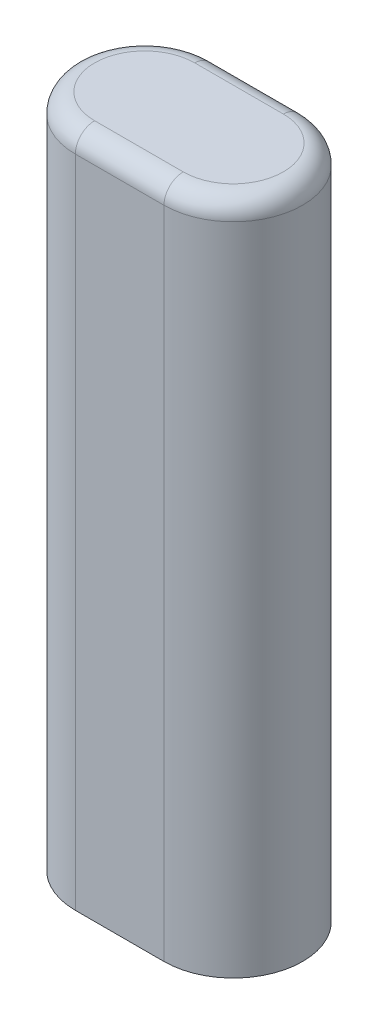
ISO-10303-21;
HEADER;
FILE_DESCRIPTION(('STEP AP214'),'2;1');
FILE_NAME('part.step','',(''),(''),'','','');
FILE_SCHEMA(('AUTOMOTIVE_DESIGN { 1 0 10303 214 1 1 1 1 }'));
ENDSEC;
DATA;
#1=APPLICATION_CONTEXT('core data for automotive mechanical design processes');
#2=APPLICATION_PROTOCOL_DEFINITION('international standard','automotive_design',2000,#1);
#3=PRODUCT_CONTEXT('',#1,'mechanical');
#4=PRODUCT('Part','Part','',(#3));
#5=PRODUCT_RELATED_PRODUCT_CATEGORY('part','',(#4));
#6=PRODUCT_DEFINITION_FORMATION('','',#4);
#7=PRODUCT_DEFINITION_CONTEXT('part definition',#1,'design');
#8=PRODUCT_DEFINITION('design','',#6,#7);
#9=PRODUCT_DEFINITION_SHAPE('','',#8);
#10=(LENGTH_UNIT() NAMED_UNIT(*) SI_UNIT(.MILLI.,.METRE.));
#11=(NAMED_UNIT(*) PLANE_ANGLE_UNIT() SI_UNIT($,.RADIAN.));
#12=(NAMED_UNIT(*) SI_UNIT($,.STERADIAN.) SOLID_ANGLE_UNIT());
#13=UNCERTAINTY_MEASURE_WITH_UNIT(LENGTH_MEASURE(1.E-05),#10,'distance_accuracy_value','');
#14=(GEOMETRIC_REPRESENTATION_CONTEXT(3) GLOBAL_UNCERTAINTY_ASSIGNED_CONTEXT((#13)) GLOBAL_UNIT_ASSIGNED_CONTEXT((#10,
#11,#12)) REPRESENTATION_CONTEXT('',''));
#15=CARTESIAN_POINT('',(0.,0.,0.));
#16=DIRECTION('',(0.,0.,1.));
#17=DIRECTION('',(1.,0.,0.));
#18=AXIS2_PLACEMENT_3D('',#15,#16,#17);
#19=CARTESIAN_POINT('',(-1.4605,22.225,0.));
#20=DIRECTION('',(0.,-1.,0.));
#21=DIRECTION('',(0.,0.,-1.));
#22=AXIS2_PLACEMENT_3D('',#19,#20,#21);
#23=CYLINDRICAL_SURFACE('',#22,2.286);
#24=DIRECTION('',(0.,-1.,0.));
#25=VECTOR('',#24,1.);
#26=CARTESIAN_POINT('',(-1.4605,22.225,2.286));
#27=LINE('',#26,#25);
#28=CARTESIAN_POINT('',(-1.4605,21.59,2.286));
#29=VERTEX_POINT('',#28);
#30=CARTESIAN_POINT('',(-1.4605,0.,2.286));
#31=VERTEX_POINT('',#30);
#32=EDGE_CURVE('E94',#29,#31,#27,.T.);
#33=ORIENTED_EDGE('',*,*,#32,.F.);
#34=CARTESIAN_POINT('',(-1.4605,21.59,0.));
#35=DIRECTION('',(0.,1.,0.));
#36=DIRECTION('',(0.,0.,1.));
#37=AXIS2_PLACEMENT_3D('',#34,#35,#36);
#38=CIRCLE('',#37,2.286);
#39=CARTESIAN_POINT('',(-1.4605,21.59,-2.286));
#40=VERTEX_POINT('',#39);
#41=EDGE_CURVE('E64',#29,#40,#38,.F.);
#42=ORIENTED_EDGE('',*,*,#41,.T.);
#43=DIRECTION('',(0.,-1.,0.));
#44=VECTOR('',#43,1.);
#45=CARTESIAN_POINT('',(-1.4605,22.225,-2.286));
#46=LINE('',#45,#44);
#47=CARTESIAN_POINT('',(-1.4605,0.,-2.286));
#48=VERTEX_POINT('',#47);
#49=EDGE_CURVE('E116',#40,#48,#46,.T.);
#50=ORIENTED_EDGE('',*,*,#49,.T.);
#51=CARTESIAN_POINT('',(-1.4605,0.,0.));
#52=DIRECTION('',(0.,1.,0.));
#53=DIRECTION('',(0.,0.,1.));
#54=AXIS2_PLACEMENT_3D('',#51,#52,#53);
#55=CIRCLE('',#54,2.286);
#56=EDGE_CURVE('E111',#48,#31,#55,.T.);
#57=ORIENTED_EDGE('',*,*,#56,.T.);
#58=EDGE_LOOP('',(#33,#42,#50,#57));
#59=FACE_BOUND('',#58,.T.);
#60=ADVANCED_FACE('F39',(#59),#23,.T.);
#61=CARTESIAN_POINT('',(-1.4605,22.225,2.286));
#62=DIRECTION('',(0.,0.,-1.));
#63=DIRECTION('',(-1.,0.,0.));
#64=AXIS2_PLACEMENT_3D('',#61,#62,#63);
#65=PLANE('',#64);
#66=DIRECTION('',(0.,-1.,0.));
#67=VECTOR('',#66,1.);
#68=CARTESIAN_POINT('',(1.4605,22.225,2.286));
#69=LINE('',#68,#67);
#70=CARTESIAN_POINT('',(1.4605,21.59,2.286));
#71=VERTEX_POINT('',#70);
#72=CARTESIAN_POINT('',(1.4605,0.,2.286));
#73=VERTEX_POINT('',#72);
#74=EDGE_CURVE('E105',#71,#73,#69,.T.);
#75=ORIENTED_EDGE('',*,*,#74,.F.);
#76=DIRECTION('',(1.,0.,0.));
#77=VECTOR('',#76,1.);
#78=CARTESIAN_POINT('',(-1.4605,21.59,2.286));
#79=LINE('',#78,#77);
#80=EDGE_CURVE('E101',#71,#29,#79,.F.);
#81=ORIENTED_EDGE('',*,*,#80,.T.);
#82=ORIENTED_EDGE('',*,*,#32,.T.);
#83=DIRECTION('',(1.,0.,0.));
#84=VECTOR('',#83,1.);
#85=CARTESIAN_POINT('',(-1.4605,0.,2.286));
#86=LINE('',#85,#84);
#87=EDGE_CURVE('E98',#31,#73,#86,.T.);
#88=ORIENTED_EDGE('',*,*,#87,.T.);
#89=EDGE_LOOP('',(#75,#81,#82,#88));
#90=FACE_BOUND('',#89,.T.);
#91=ADVANCED_FACE('F97',(#90),#65,.F.);
#92=CARTESIAN_POINT('',(1.4605,22.225,0.));
#93=DIRECTION('',(0.,-1.,0.));
#94=DIRECTION('',(0.,0.,-1.));
#95=AXIS2_PLACEMENT_3D('',#92,#93,#94);
#96=CYLINDRICAL_SURFACE('',#95,2.286);
#97=DIRECTION('',(0.,-1.,0.));
#98=VECTOR('',#97,1.);
#99=CARTESIAN_POINT('',(1.4605,22.225,-2.286));
#100=LINE('',#99,#98);
#101=CARTESIAN_POINT('',(1.4605,21.59,-2.286));
#102=VERTEX_POINT('',#101);
#103=CARTESIAN_POINT('',(1.4605,0.,-2.286));
#104=VERTEX_POINT('',#103);
#105=EDGE_CURVE('E134',#102,#104,#100,.T.);
#106=ORIENTED_EDGE('',*,*,#105,.F.);
#107=CARTESIAN_POINT('',(1.4605,21.59,0.));
#108=DIRECTION('',(0.,1.,0.));
#109=DIRECTION('',(0.,0.,1.));
#110=AXIS2_PLACEMENT_3D('',#107,#108,#109);
#111=CIRCLE('',#110,2.286);
#112=EDGE_CURVE('E11',#102,#71,#111,.F.);
#113=ORIENTED_EDGE('',*,*,#112,.T.);
#114=ORIENTED_EDGE('',*,*,#74,.T.);
#115=CARTESIAN_POINT('',(1.4605,0.,0.));
#116=DIRECTION('',(0.,1.,0.));
#117=DIRECTION('',(0.,0.,1.));
#118=AXIS2_PLACEMENT_3D('',#115,#116,#117);
#119=CIRCLE('',#118,2.286);
#120=EDGE_CURVE('E113',#73,#104,#119,.T.);
#121=ORIENTED_EDGE('',*,*,#120,.T.);
#122=EDGE_LOOP('',(#106,#113,#114,#121));
#123=FACE_BOUND('',#122,.T.);
#124=ADVANCED_FACE('F194',(#123),#96,.T.);
#125=CARTESIAN_POINT('',(-1.4605,22.225,-2.286));
#126=DIRECTION('',(0.,0.,1.));
#127=DIRECTION('',(1.,0.,0.));
#128=AXIS2_PLACEMENT_3D('',#125,#126,#127);
#129=PLANE('',#128);
#130=ORIENTED_EDGE('',*,*,#49,.F.);
#131=DIRECTION('',(-1.,0.,0.));
#132=VECTOR('',#131,1.);
#133=CARTESIAN_POINT('',(1.4605,21.59,-2.286));
#134=LINE('',#133,#132);
#135=EDGE_CURVE('E49',#40,#102,#134,.F.);
#136=ORIENTED_EDGE('',*,*,#135,.T.);
#137=ORIENTED_EDGE('',*,*,#105,.T.);
#138=DIRECTION('',(-1.,0.,0.));
#139=VECTOR('',#138,1.);
#140=CARTESIAN_POINT('',(-1.4605,0.,-2.286));
#141=LINE('',#140,#139);
#142=EDGE_CURVE('E129',#104,#48,#141,.T.);
#143=ORIENTED_EDGE('',*,*,#142,.T.);
#144=EDGE_LOOP('',(#130,#136,#137,#143));
#145=FACE_BOUND('',#144,.T.);
#146=ADVANCED_FACE('F216',(#145),#129,.F.);
#147=CARTESIAN_POINT('',(-1.4605,22.225,0.));
#148=DIRECTION('',(0.,1.,0.));
#149=DIRECTION('',(0.,0.,1.));
#150=AXIS2_PLACEMENT_3D('',#147,#148,#149);
#151=PLANE('',#150);
#152=CARTESIAN_POINT('',(-1.4605,22.225,0.));
#153=DIRECTION('',(0.,1.,0.));
#154=DIRECTION('',(0.,0.,1.));
#155=AXIS2_PLACEMENT_3D('',#152,#153,#154);
#156=CIRCLE('',#155,1.651);
#157=CARTESIAN_POINT('',(-1.4605,22.225,-1.651));
#158=VERTEX_POINT('',#157);
#159=CARTESIAN_POINT('',(-1.4605,22.225,1.651));
#160=VERTEX_POINT('',#159);
#161=EDGE_CURVE('E144',#158,#160,#156,.T.);
#162=ORIENTED_EDGE('',*,*,#161,.T.);
#163=DIRECTION('',(1.,0.,0.));
#164=VECTOR('',#163,1.);
#165=CARTESIAN_POINT('',(1.4605,22.225,1.651));
#166=LINE('',#165,#164);
#167=CARTESIAN_POINT('',(1.4605,22.225,1.651));
#168=VERTEX_POINT('',#167);
#169=EDGE_CURVE('E147',#160,#168,#166,.T.);
#170=ORIENTED_EDGE('',*,*,#169,.T.);
#171=CARTESIAN_POINT('',(1.4605,22.225,0.));
#172=DIRECTION('',(0.,1.,0.));
#173=DIRECTION('',(0.,0.,1.));
#174=AXIS2_PLACEMENT_3D('',#171,#172,#173);
#175=CIRCLE('',#174,1.651);
#176=CARTESIAN_POINT('',(1.4605,22.225,-1.651));
#177=VERTEX_POINT('',#176);
#178=EDGE_CURVE('E104',#168,#177,#175,.T.);
#179=ORIENTED_EDGE('',*,*,#178,.T.);
#180=DIRECTION('',(-1.,0.,0.));
#181=VECTOR('',#180,1.);
#182=CARTESIAN_POINT('',(-1.4605,22.225,-1.651));
#183=LINE('',#182,#181);
#184=EDGE_CURVE('E141',#177,#158,#183,.T.);
#185=ORIENTED_EDGE('',*,*,#184,.T.);
#186=EDGE_LOOP('',(#162,#170,#179,#185));
#187=FACE_BOUND('',#186,.T.);
#188=ADVANCED_FACE('F176',(#187),#151,.T.);
#189=CARTESIAN_POINT('',(-1.4605,0.,0.));
#190=DIRECTION('',(0.,1.,0.));
#191=DIRECTION('',(0.,0.,1.));
#192=AXIS2_PLACEMENT_3D('',#189,#190,#191);
#193=PLANE('',#192);
#194=CARTESIAN_POINT('',(0.,0.,0.));
#195=DIRECTION('',(0.,-1.,0.));
#196=DIRECTION('',(0.,0.,-1.));
#197=AXIS2_PLACEMENT_3D('',#194,#195,#196);
#198=CIRCLE('',#197,1.778);
#199=CARTESIAN_POINT('',(0.,0.,-1.778));
#200=VERTEX_POINT('',#199);
#201=EDGE_CURVE('E124',#200,#200,#198,.T.);
#202=ORIENTED_EDGE('',*,*,#201,.F.);
#203=EDGE_LOOP('',(#202));
#204=FACE_BOUND('',#203,.T.);
#205=ORIENTED_EDGE('',*,*,#56,.F.);
#206=ORIENTED_EDGE('',*,*,#142,.F.);
#207=ORIENTED_EDGE('',*,*,#120,.F.);
#208=ORIENTED_EDGE('',*,*,#87,.F.);
#209=EDGE_LOOP('',(#205,#206,#207,#208));
#210=FACE_BOUND('',#209,.T.);
#211=ADVANCED_FACE('F109',(#204,#210),#193,.F.);
#212=CARTESIAN_POINT('',(-1.4605,21.59,-1.651));
#213=DIRECTION('',(1.,0.,0.));
#214=DIRECTION('',(0.,0.,-1.));
#215=AXIS2_PLACEMENT_3D('',#212,#213,#214);
#216=CYLINDRICAL_SURFACE('',#215,0.635);
#217=CARTESIAN_POINT('',(1.4605,21.59,-1.651));
#218=DIRECTION('',(1.,0.,0.));
#219=DIRECTION('',(0.,0.,-1.));
#220=AXIS2_PLACEMENT_3D('',#217,#218,#219);
#221=CIRCLE('',#220,0.635);
#222=EDGE_CURVE('E122',#102,#177,#221,.T.);
#223=ORIENTED_EDGE('',*,*,#222,.F.);
#224=ORIENTED_EDGE('',*,*,#135,.F.);
#225=CARTESIAN_POINT('',(-1.4605,21.59,-1.651));
#226=DIRECTION('',(-1.,0.,0.));
#227=DIRECTION('',(0.,0.,1.));
#228=AXIS2_PLACEMENT_3D('',#225,#226,#227);
#229=CIRCLE('',#228,0.635);
#230=EDGE_CURVE('E43',#158,#40,#229,.T.);
#231=ORIENTED_EDGE('',*,*,#230,.F.);
#232=ORIENTED_EDGE('',*,*,#184,.F.);
#233=EDGE_LOOP('',(#223,#224,#231,#232));
#234=FACE_BOUND('',#233,.T.);
#235=ADVANCED_FACE('F41',(#234),#216,.T.);
#236=CARTESIAN_POINT('',(-1.4605,21.59,0.));
#237=DIRECTION('',(0.,1.,0.));
#238=DIRECTION('',(0.,0.,1.));
#239=AXIS2_PLACEMENT_3D('',#236,#237,#238);
#240=TOROIDAL_SURFACE('',#239,1.651,0.635);
#241=ORIENTED_EDGE('',*,*,#230,.T.);
#242=ORIENTED_EDGE('',*,*,#41,.F.);
#243=CARTESIAN_POINT('',(-1.4605,21.59,1.651));
#244=DIRECTION('',(1.,0.,0.));
#245=DIRECTION('',(0.,0.,-1.));
#246=AXIS2_PLACEMENT_3D('',#243,#244,#245);
#247=CIRCLE('',#246,0.635);
#248=EDGE_CURVE('E160',#160,#29,#247,.T.);
#249=ORIENTED_EDGE('',*,*,#248,.F.);
#250=ORIENTED_EDGE('',*,*,#161,.F.);
#251=EDGE_LOOP('',(#241,#242,#249,#250));
#252=FACE_BOUND('',#251,.T.);
#253=ADVANCED_FACE('F182',(#252),#240,.T.);
#254=CARTESIAN_POINT('',(1.4605,21.59,0.));
#255=DIRECTION('',(0.,1.,0.));
#256=DIRECTION('',(0.,0.,1.));
#257=AXIS2_PLACEMENT_3D('',#254,#255,#256);
#258=TOROIDAL_SURFACE('',#257,1.651,0.635);
#259=ORIENTED_EDGE('',*,*,#222,.T.);
#260=ORIENTED_EDGE('',*,*,#178,.F.);
#261=CARTESIAN_POINT('',(1.4605,21.59,1.651));
#262=DIRECTION('',(-1.,0.,0.));
#263=DIRECTION('',(0.,0.,1.));
#264=AXIS2_PLACEMENT_3D('',#261,#262,#263);
#265=CIRCLE('',#264,0.635);
#266=EDGE_CURVE('E157',#71,#168,#265,.T.);
#267=ORIENTED_EDGE('',*,*,#266,.F.);
#268=ORIENTED_EDGE('',*,*,#112,.F.);
#269=EDGE_LOOP('',(#259,#260,#267,#268));
#270=FACE_BOUND('',#269,.T.);
#271=ADVANCED_FACE('F169',(#270),#258,.T.);
#272=CARTESIAN_POINT('',(-1.4605,21.59,1.651));
#273=DIRECTION('',(-1.,0.,0.));
#274=DIRECTION('',(0.,0.,1.));
#275=AXIS2_PLACEMENT_3D('',#272,#273,#274);
#276=CYLINDRICAL_SURFACE('',#275,0.635);
#277=ORIENTED_EDGE('',*,*,#248,.T.);
#278=ORIENTED_EDGE('',*,*,#80,.F.);
#279=ORIENTED_EDGE('',*,*,#266,.T.);
#280=ORIENTED_EDGE('',*,*,#169,.F.);
#281=EDGE_LOOP('',(#277,#278,#279,#280));
#282=FACE_BOUND('',#281,.T.);
#283=ADVANCED_FACE('F180',(#282),#276,.T.);
#284=CARTESIAN_POINT('',(0.,8.255,0.));
#285=DIRECTION('',(0.,-1.,0.));
#286=DIRECTION('',(0.,0.,-1.));
#287=AXIS2_PLACEMENT_3D('',#284,#285,#286);
#288=CYLINDRICAL_SURFACE('',#287,1.778);
#289=CARTESIAN_POINT('',(0.,8.255,0.));
#290=DIRECTION('',(0.,-1.,0.));
#291=DIRECTION('',(0.,0.,-1.));
#292=AXIS2_PLACEMENT_3D('',#289,#290,#291);
#293=CIRCLE('',#292,1.778);
#294=CARTESIAN_POINT('',(0.,8.255,-1.778));
#295=VERTEX_POINT('',#294);
#296=EDGE_CURVE('E161',#295,#295,#293,.T.);
#297=ORIENTED_EDGE('',*,*,#296,.F.);
#298=EDGE_LOOP('',(#297));
#299=FACE_BOUND('',#298,.T.);
#300=ORIENTED_EDGE('',*,*,#201,.T.);
#301=EDGE_LOOP('',(#300));
#302=FACE_BOUND('',#301,.T.);
#303=ADVANCED_FACE('F199',(#299,#302),#288,.F.);
#304=CARTESIAN_POINT('',(0.,8.255,0.));
#305=DIRECTION('',(0.,-1.,0.));
#306=DIRECTION('',(0.,0.,-1.));
#307=AXIS2_PLACEMENT_3D('',#304,#305,#306);
#308=PLANE('',#307);
#309=ORIENTED_EDGE('',*,*,#296,.T.);
#310=EDGE_LOOP('',(#309));
#311=FACE_BOUND('',#310,.T.);
#312=ADVANCED_FACE('F203',(#311),#308,.T.);
#313=CLOSED_SHELL('',(#60,#91,#124,#146,#188,#211,#235,#253,#271,#283,#303,#312));
#314=MANIFOLD_SOLID_BREP('B2',#313);
#315=ADVANCED_BREP_SHAPE_REPRESENTATION('',(#18,#314),#14);
#316=SHAPE_DEFINITION_REPRESENTATION(#9,#315);
ENDSEC;
END-ISO-10303-21;
